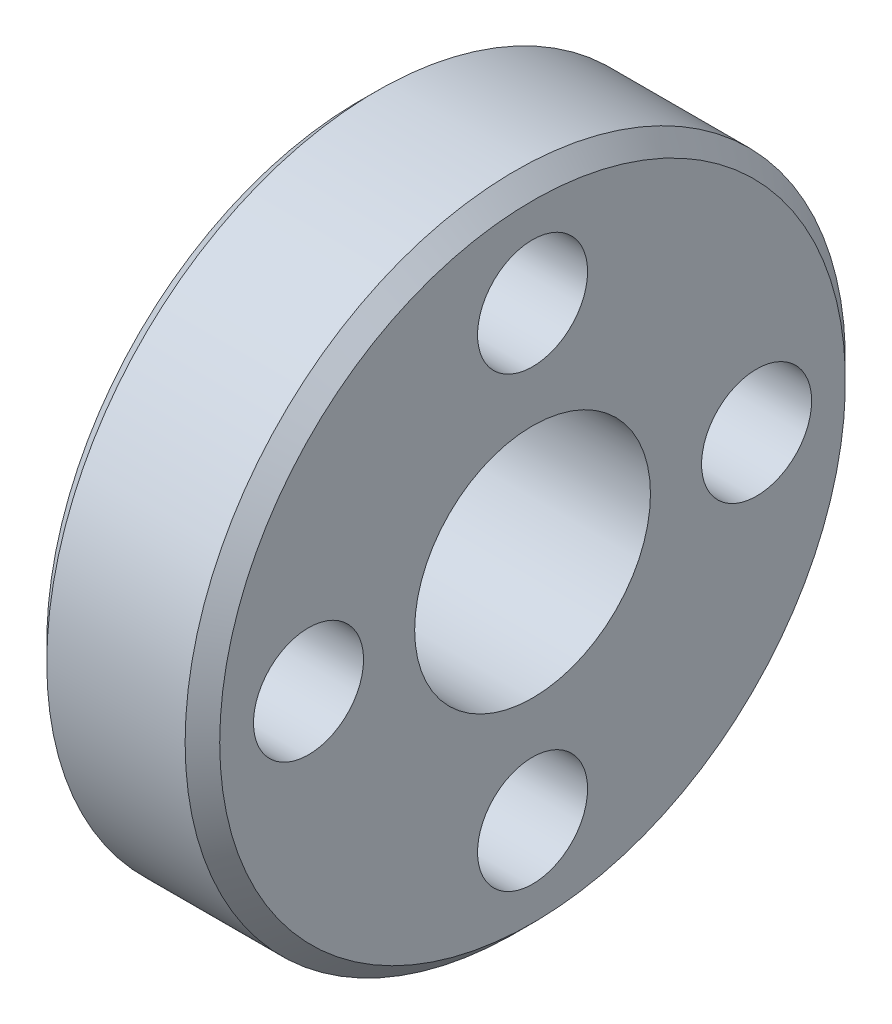
ISO-10303-21;
HEADER;
FILE_DESCRIPTION(('STEP AP214'),'2;1');
FILE_NAME('part.step','',(''),(''),'','','');
FILE_SCHEMA(('AUTOMOTIVE_DESIGN { 1 0 10303 214 1 1 1 1 }'));
ENDSEC;
DATA;
#1=APPLICATION_CONTEXT('core data for automotive mechanical design processes');
#2=APPLICATION_PROTOCOL_DEFINITION('international standard','automotive_design',2000,#1);
#3=PRODUCT_CONTEXT('',#1,'mechanical');
#4=PRODUCT('Part','Part','',(#3));
#5=PRODUCT_RELATED_PRODUCT_CATEGORY('part','',(#4));
#6=PRODUCT_DEFINITION_FORMATION('','',#4);
#7=PRODUCT_DEFINITION_CONTEXT('part definition',#1,'design');
#8=PRODUCT_DEFINITION('design','',#6,#7);
#9=PRODUCT_DEFINITION_SHAPE('','',#8);
#10=(LENGTH_UNIT() NAMED_UNIT(*) SI_UNIT(.MILLI.,.METRE.));
#11=(NAMED_UNIT(*) PLANE_ANGLE_UNIT() SI_UNIT($,.RADIAN.));
#12=(NAMED_UNIT(*) SI_UNIT($,.STERADIAN.) SOLID_ANGLE_UNIT());
#13=UNCERTAINTY_MEASURE_WITH_UNIT(LENGTH_MEASURE(1.E-05),#10,'distance_accuracy_value','');
#14=(GEOMETRIC_REPRESENTATION_CONTEXT(3) GLOBAL_UNCERTAINTY_ASSIGNED_CONTEXT((#13)) GLOBAL_UNIT_ASSIGNED_CONTEXT((#10,
#11,#12)) REPRESENTATION_CONTEXT('',''));
#15=CARTESIAN_POINT('',(0.,0.,0.));
#16=DIRECTION('',(0.,0.,1.));
#17=DIRECTION('',(1.,0.,0.));
#18=AXIS2_PLACEMENT_3D('',#15,#16,#17);
#19=CARTESIAN_POINT('',(9.89999999999999,0.,0.));
#20=DIRECTION('',(-1.,0.,0.));
#21=DIRECTION('',(0.,0.,1.));
#22=AXIS2_PLACEMENT_3D('',#19,#20,#21);
#23=CONICAL_SURFACE('',#22,21.,0.785398163397448);
#24=CARTESIAN_POINT('',(9.9,0.,0.));
#25=DIRECTION('',(-1.,0.,0.));
#26=DIRECTION('',(0.,0.,1.));
#27=AXIS2_PLACEMENT_3D('',#24,#25,#26);
#28=CIRCLE('',#27,21.);
#29=CARTESIAN_POINT('',(9.9,0.,21.));
#30=VERTEX_POINT('',#29);
#31=EDGE_CURVE('E30',#30,#30,#28,.T.);
#32=ORIENTED_EDGE('',*,*,#31,.F.);
#33=EDGE_LOOP('',(#32));
#34=FACE_BOUND('',#33,.T.);
#35=CARTESIAN_POINT('',(11.,0.,0.));
#36=DIRECTION('',(-1.,0.,0.));
#37=DIRECTION('',(0.,0.,1.));
#38=AXIS2_PLACEMENT_3D('',#35,#36,#37);
#39=CIRCLE('',#38,19.9);
#40=CARTESIAN_POINT('',(11.,0.,19.9));
#41=VERTEX_POINT('',#40);
#42=EDGE_CURVE('E18',#41,#41,#39,.F.);
#43=ORIENTED_EDGE('',*,*,#42,.F.);
#44=EDGE_LOOP('',(#43));
#45=FACE_BOUND('',#44,.T.);
#46=ADVANCED_FACE('F15',(#34,#45),#23,.T.);
#47=CARTESIAN_POINT('',(11.,0.,0.));
#48=DIRECTION('',(-1.,0.,0.));
#49=DIRECTION('',(0.,0.,1.));
#50=AXIS2_PLACEMENT_3D('',#47,#48,#49);
#51=CYLINDRICAL_SURFACE('',#50,21.);
#52=ORIENTED_EDGE('',*,*,#31,.T.);
#53=EDGE_LOOP('',(#52));
#54=FACE_BOUND('',#53,.T.);
#55=CARTESIAN_POINT('',(1.10000000000001,0.,0.));
#56=DIRECTION('',(1.,0.,0.));
#57=DIRECTION('',(0.,0.,-1.));
#58=AXIS2_PLACEMENT_3D('',#55,#56,#57);
#59=CIRCLE('',#58,21.);
#60=CARTESIAN_POINT('',(1.10000000000001,0.,-21.));
#61=VERTEX_POINT('',#60);
#62=EDGE_CURVE('E47',#61,#61,#59,.F.);
#63=ORIENTED_EDGE('',*,*,#62,.F.);
#64=EDGE_LOOP('',(#63));
#65=FACE_BOUND('',#64,.T.);
#66=ADVANCED_FACE('F66',(#54,#65),#51,.T.);
#67=CARTESIAN_POINT('',(11.,0.,0.));
#68=DIRECTION('',(1.,0.,0.));
#69=DIRECTION('',(0.,0.,-1.));
#70=AXIS2_PLACEMENT_3D('',#67,#68,#69);
#71=PLANE('',#70);
#72=CARTESIAN_POINT('',(11.,0.,0.));
#73=DIRECTION('',(-1.,0.,0.));
#74=DIRECTION('',(0.,0.,1.));
#75=AXIS2_PLACEMENT_3D('',#72,#73,#74);
#76=CIRCLE('',#75,7.5);
#77=CARTESIAN_POINT('',(11.,0.,7.5));
#78=VERTEX_POINT('',#77);
#79=EDGE_CURVE('E44',#78,#78,#76,.T.);
#80=ORIENTED_EDGE('',*,*,#79,.T.);
#81=EDGE_LOOP('',(#80));
#82=FACE_BOUND('',#81,.T.);
#83=ORIENTED_EDGE('',*,*,#42,.T.);
#84=EDGE_LOOP('',(#83));
#85=FACE_BOUND('',#84,.T.);
#86=CARTESIAN_POINT('',(11.,14.25,0.));
#87=DIRECTION('',(1.,0.,0.));
#88=DIRECTION('',(0.,0.,-1.));
#89=AXIS2_PLACEMENT_3D('',#86,#87,#88);
#90=CIRCLE('',#89,3.5);
#91=CARTESIAN_POINT('',(11.,14.25,-3.5));
#92=VERTEX_POINT('',#91);
#93=EDGE_CURVE('E48',#92,#92,#90,.F.);
#94=ORIENTED_EDGE('',*,*,#93,.T.);
#95=EDGE_LOOP('',(#94));
#96=FACE_BOUND('',#95,.T.);
#97=CARTESIAN_POINT('',(11.,0.,-14.25));
#98=DIRECTION('',(1.,0.,0.));
#99=DIRECTION('',(0.,0.,-1.));
#100=AXIS2_PLACEMENT_3D('',#97,#98,#99);
#101=CIRCLE('',#100,3.5);
#102=CARTESIAN_POINT('',(11.,0.,-17.75));
#103=VERTEX_POINT('',#102);
#104=EDGE_CURVE('E51',#103,#103,#101,.F.);
#105=ORIENTED_EDGE('',*,*,#104,.T.);
#106=EDGE_LOOP('',(#105));
#107=FACE_BOUND('',#106,.T.);
#108=CARTESIAN_POINT('',(11.,-14.25,0.));
#109=DIRECTION('',(1.,0.,0.));
#110=DIRECTION('',(0.,0.,-1.));
#111=AXIS2_PLACEMENT_3D('',#108,#109,#110);
#112=CIRCLE('',#111,3.5);
#113=CARTESIAN_POINT('',(11.,-14.25,-3.5));
#114=VERTEX_POINT('',#113);
#115=EDGE_CURVE('E54',#114,#114,#112,.F.);
#116=ORIENTED_EDGE('',*,*,#115,.T.);
#117=EDGE_LOOP('',(#116));
#118=FACE_BOUND('',#117,.T.);
#119=CARTESIAN_POINT('',(11.,0.,14.25));
#120=DIRECTION('',(1.,0.,0.));
#121=DIRECTION('',(0.,0.,-1.));
#122=AXIS2_PLACEMENT_3D('',#119,#120,#121);
#123=CIRCLE('',#122,3.5);
#124=CARTESIAN_POINT('',(11.,0.,10.75));
#125=VERTEX_POINT('',#124);
#126=EDGE_CURVE('E56',#125,#125,#123,.F.);
#127=ORIENTED_EDGE('',*,*,#126,.T.);
#128=EDGE_LOOP('',(#127));
#129=FACE_BOUND('',#128,.T.);
#130=ADVANCED_FACE('F75',(#82,#85,#96,#107,#118,#129),#71,.T.);
#131=CARTESIAN_POINT('',(0.,0.,14.25));
#132=DIRECTION('',(1.,0.,0.));
#133=DIRECTION('',(0.,0.,-1.));
#134=AXIS2_PLACEMENT_3D('',#131,#132,#133);
#135=CYLINDRICAL_SURFACE('',#134,3.5);
#136=CARTESIAN_POINT('',(0.,0.,14.25));
#137=DIRECTION('',(1.,0.,0.));
#138=DIRECTION('',(0.,0.,-1.));
#139=AXIS2_PLACEMENT_3D('',#136,#137,#138);
#140=CIRCLE('',#139,3.5);
#141=CARTESIAN_POINT('',(0.,0.,10.75));
#142=VERTEX_POINT('',#141);
#143=EDGE_CURVE('E41',#142,#142,#140,.F.);
#144=ORIENTED_EDGE('',*,*,#143,.T.);
#145=EDGE_LOOP('',(#144));
#146=FACE_BOUND('',#145,.T.);
#147=ORIENTED_EDGE('',*,*,#126,.F.);
#148=EDGE_LOOP('',(#147));
#149=FACE_BOUND('',#148,.T.);
#150=ADVANCED_FACE('F102',(#146,#149),#135,.F.);
#151=CARTESIAN_POINT('',(0.,-14.25,0.));
#152=DIRECTION('',(1.,0.,0.));
#153=DIRECTION('',(0.,0.,-1.));
#154=AXIS2_PLACEMENT_3D('',#151,#152,#153);
#155=CYLINDRICAL_SURFACE('',#154,3.5);
#156=CARTESIAN_POINT('',(0.,-14.25,0.));
#157=DIRECTION('',(1.,0.,0.));
#158=DIRECTION('',(0.,0.,-1.));
#159=AXIS2_PLACEMENT_3D('',#156,#157,#158);
#160=CIRCLE('',#159,3.5);
#161=CARTESIAN_POINT('',(0.,-14.25,-3.5));
#162=VERTEX_POINT('',#161);
#163=EDGE_CURVE('E38',#162,#162,#160,.F.);
#164=ORIENTED_EDGE('',*,*,#163,.T.);
#165=EDGE_LOOP('',(#164));
#166=FACE_BOUND('',#165,.T.);
#167=ORIENTED_EDGE('',*,*,#115,.F.);
#168=EDGE_LOOP('',(#167));
#169=FACE_BOUND('',#168,.T.);
#170=ADVANCED_FACE('F98',(#166,#169),#155,.F.);
#171=CARTESIAN_POINT('',(0.,0.,-14.25));
#172=DIRECTION('',(1.,0.,0.));
#173=DIRECTION('',(0.,0.,-1.));
#174=AXIS2_PLACEMENT_3D('',#171,#172,#173);
#175=CYLINDRICAL_SURFACE('',#174,3.5);
#176=CARTESIAN_POINT('',(0.,0.,-14.25));
#177=DIRECTION('',(1.,0.,0.));
#178=DIRECTION('',(0.,0.,-1.));
#179=AXIS2_PLACEMENT_3D('',#176,#177,#178);
#180=CIRCLE('',#179,3.5);
#181=CARTESIAN_POINT('',(0.,0.,-17.75));
#182=VERTEX_POINT('',#181);
#183=EDGE_CURVE('E35',#182,#182,#180,.F.);
#184=ORIENTED_EDGE('',*,*,#183,.T.);
#185=EDGE_LOOP('',(#184));
#186=FACE_BOUND('',#185,.T.);
#187=ORIENTED_EDGE('',*,*,#104,.F.);
#188=EDGE_LOOP('',(#187));
#189=FACE_BOUND('',#188,.T.);
#190=ADVANCED_FACE('F94',(#186,#189),#175,.F.);
#191=CARTESIAN_POINT('',(0.,14.25,0.));
#192=DIRECTION('',(1.,0.,0.));
#193=DIRECTION('',(0.,0.,-1.));
#194=AXIS2_PLACEMENT_3D('',#191,#192,#193);
#195=CYLINDRICAL_SURFACE('',#194,3.5);
#196=CARTESIAN_POINT('',(0.,14.25,0.));
#197=DIRECTION('',(1.,0.,0.));
#198=DIRECTION('',(0.,0.,-1.));
#199=AXIS2_PLACEMENT_3D('',#196,#197,#198);
#200=CIRCLE('',#199,3.5);
#201=CARTESIAN_POINT('',(0.,14.25,-3.5));
#202=VERTEX_POINT('',#201);
#203=EDGE_CURVE('E27',#202,#202,#200,.F.);
#204=ORIENTED_EDGE('',*,*,#203,.T.);
#205=EDGE_LOOP('',(#204));
#206=FACE_BOUND('',#205,.T.);
#207=ORIENTED_EDGE('',*,*,#93,.F.);
#208=EDGE_LOOP('',(#207));
#209=FACE_BOUND('',#208,.T.);
#210=ADVANCED_FACE('F90',(#206,#209),#195,.F.);
#211=CARTESIAN_POINT('',(1.10000000000001,0.,0.));
#212=DIRECTION('',(1.,0.,0.));
#213=DIRECTION('',(0.,0.,-1.));
#214=AXIS2_PLACEMENT_3D('',#211,#212,#213);
#215=CONICAL_SURFACE('',#214,21.,0.785398163397452);
#216=CARTESIAN_POINT('',(0.,0.,0.));
#217=DIRECTION('',(1.,0.,0.));
#218=DIRECTION('',(0.,0.,-1.));
#219=AXIS2_PLACEMENT_3D('',#216,#217,#218);
#220=CIRCLE('',#219,19.9);
#221=CARTESIAN_POINT('',(0.,0.,-19.9));
#222=VERTEX_POINT('',#221);
#223=EDGE_CURVE('E22',#222,#222,#220,.T.);
#224=ORIENTED_EDGE('',*,*,#223,.T.);
#225=EDGE_LOOP('',(#224));
#226=FACE_BOUND('',#225,.T.);
#227=ORIENTED_EDGE('',*,*,#62,.T.);
#228=EDGE_LOOP('',(#227));
#229=FACE_BOUND('',#228,.T.);
#230=ADVANCED_FACE('F84',(#226,#229),#215,.T.);
#231=CARTESIAN_POINT('',(11.,0.,0.));
#232=DIRECTION('',(-1.,0.,0.));
#233=DIRECTION('',(0.,0.,1.));
#234=AXIS2_PLACEMENT_3D('',#231,#232,#233);
#235=CYLINDRICAL_SURFACE('',#234,7.5);
#236=CARTESIAN_POINT('',(0.,0.,0.));
#237=DIRECTION('',(-1.,0.,0.));
#238=DIRECTION('',(0.,0.,1.));
#239=AXIS2_PLACEMENT_3D('',#236,#237,#238);
#240=CIRCLE('',#239,7.5);
#241=CARTESIAN_POINT('',(0.,0.,7.5));
#242=VERTEX_POINT('',#241);
#243=EDGE_CURVE('E10',#242,#242,#240,.T.);
#244=ORIENTED_EDGE('',*,*,#243,.T.);
#245=EDGE_LOOP('',(#244));
#246=FACE_BOUND('',#245,.T.);
#247=ORIENTED_EDGE('',*,*,#79,.F.);
#248=EDGE_LOOP('',(#247));
#249=FACE_BOUND('',#248,.T.);
#250=ADVANCED_FACE('F78',(#246,#249),#235,.F.);
#251=CARTESIAN_POINT('',(0.,0.,0.));
#252=DIRECTION('',(1.,0.,0.));
#253=DIRECTION('',(0.,0.,-1.));
#254=AXIS2_PLACEMENT_3D('',#251,#252,#253);
#255=PLANE('',#254);
#256=ORIENTED_EDGE('',*,*,#243,.F.);
#257=EDGE_LOOP('',(#256));
#258=FACE_BOUND('',#257,.T.);
#259=ORIENTED_EDGE('',*,*,#223,.F.);
#260=EDGE_LOOP('',(#259));
#261=FACE_BOUND('',#260,.T.);
#262=ORIENTED_EDGE('',*,*,#203,.F.);
#263=EDGE_LOOP('',(#262));
#264=FACE_BOUND('',#263,.T.);
#265=ORIENTED_EDGE('',*,*,#183,.F.);
#266=EDGE_LOOP('',(#265));
#267=FACE_BOUND('',#266,.T.);
#268=ORIENTED_EDGE('',*,*,#163,.F.);
#269=EDGE_LOOP('',(#268));
#270=FACE_BOUND('',#269,.T.);
#271=ORIENTED_EDGE('',*,*,#143,.F.);
#272=EDGE_LOOP('',(#271));
#273=FACE_BOUND('',#272,.T.);
#274=ADVANCED_FACE('F76',(#258,#261,#264,#267,#270,#273),#255,.F.);
#275=CLOSED_SHELL('',(#46,#66,#130,#150,#170,#190,#210,#230,#250,#274));
#276=MANIFOLD_SOLID_BREP('B1',#275);
#277=ADVANCED_BREP_SHAPE_REPRESENTATION('',(#18,#276),#14);
#278=SHAPE_DEFINITION_REPRESENTATION(#9,#277);
ENDSEC;
END-ISO-10303-21;
